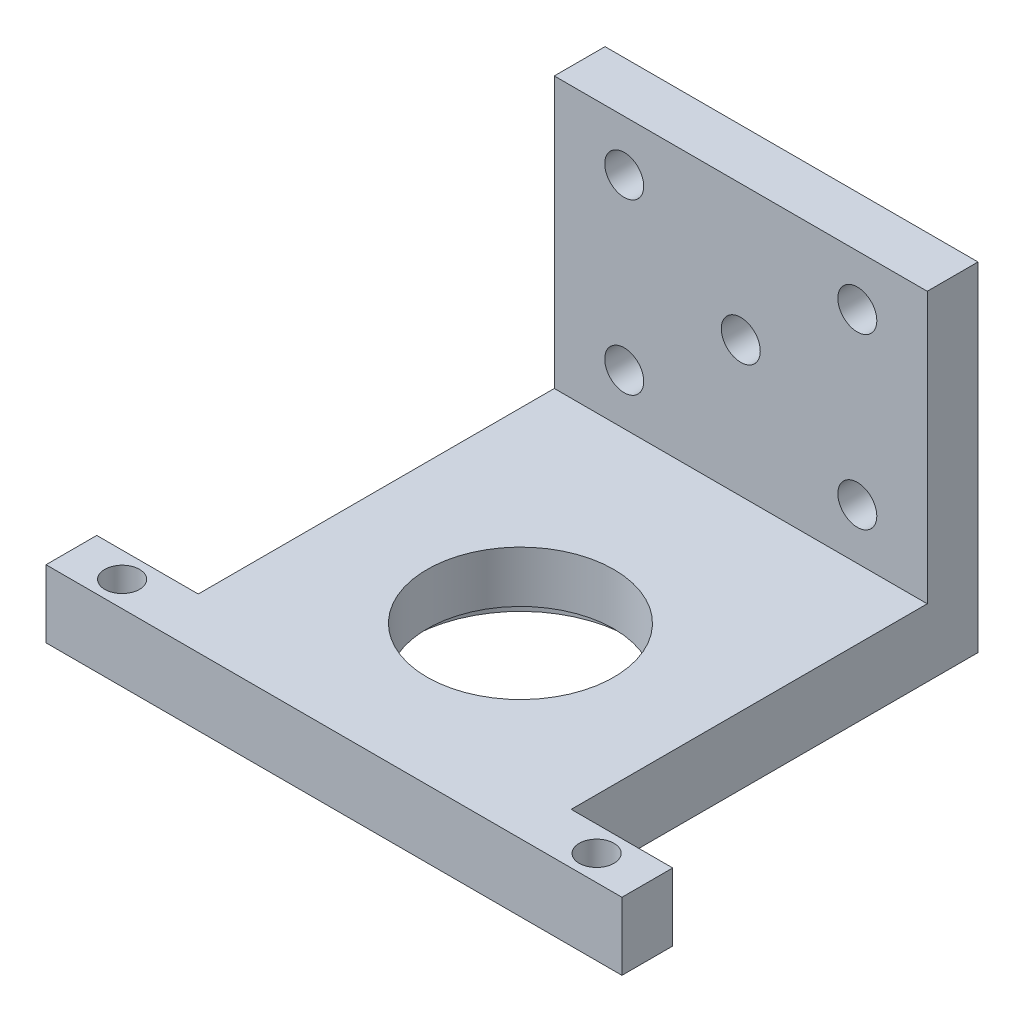
ISO-10303-21;
HEADER;
FILE_DESCRIPTION(('STEP AP214'),'2;1');
FILE_NAME('part.step','',(''),(''),'','','');
FILE_SCHEMA(('AUTOMOTIVE_DESIGN { 1 0 10303 214 1 1 1 1 }'));
ENDSEC;
DATA;
#1=APPLICATION_CONTEXT('core data for automotive mechanical design processes');
#2=APPLICATION_PROTOCOL_DEFINITION('international standard','automotive_design',2000,#1);
#3=PRODUCT_CONTEXT('',#1,'mechanical');
#4=PRODUCT('Part','Part','',(#3));
#5=PRODUCT_RELATED_PRODUCT_CATEGORY('part','',(#4));
#6=PRODUCT_DEFINITION_FORMATION('','',#4);
#7=PRODUCT_DEFINITION_CONTEXT('part definition',#1,'design');
#8=PRODUCT_DEFINITION('design','',#6,#7);
#9=PRODUCT_DEFINITION_SHAPE('','',#8);
#10=(LENGTH_UNIT() NAMED_UNIT(*) SI_UNIT(.MILLI.,.METRE.));
#11=(NAMED_UNIT(*) PLANE_ANGLE_UNIT() SI_UNIT($,.RADIAN.));
#12=(NAMED_UNIT(*) SI_UNIT($,.STERADIAN.) SOLID_ANGLE_UNIT());
#13=UNCERTAINTY_MEASURE_WITH_UNIT(LENGTH_MEASURE(1.E-05),#10,'distance_accuracy_value','');
#14=(GEOMETRIC_REPRESENTATION_CONTEXT(3) GLOBAL_UNCERTAINTY_ASSIGNED_CONTEXT((#13)) GLOBAL_UNIT_ASSIGNED_CONTEXT((#10,
#11,#12)) REPRESENTATION_CONTEXT('',''));
#15=CARTESIAN_POINT('',(0.,0.,0.));
#16=DIRECTION('',(0.,0.,1.));
#17=DIRECTION('',(1.,0.,0.));
#18=AXIS2_PLACEMENT_3D('',#15,#16,#17);
#19=CARTESIAN_POINT('',(0.,6.35,0.));
#20=DIRECTION('',(1.,0.,0.));
#21=DIRECTION('',(0.,0.,-1.));
#22=AXIS2_PLACEMENT_3D('',#19,#20,#21);
#23=PLANE('',#22);
#24=DIRECTION('',(0.,-1.,0.));
#25=VECTOR('',#24,1.);
#26=CARTESIAN_POINT('',(0.,6.35,-4.7625));
#27=LINE('',#26,#25);
#28=CARTESIAN_POINT('',(0.,6.35,-4.7625));
#29=VERTEX_POINT('',#28);
#30=CARTESIAN_POINT('',(0.,0.,-4.7625));
#31=VERTEX_POINT('',#30);
#32=EDGE_CURVE('E60',#29,#31,#27,.T.);
#33=ORIENTED_EDGE('',*,*,#32,.F.);
#34=DIRECTION('',(0.,0.,1.));
#35=VECTOR('',#34,1.);
#36=CARTESIAN_POINT('',(0.,6.35,0.));
#37=LINE('',#36,#35);
#38=CARTESIAN_POINT('',(0.,6.35,-38.175));
#39=VERTEX_POINT('',#38);
#40=EDGE_CURVE('E130',#39,#29,#37,.T.);
#41=ORIENTED_EDGE('',*,*,#40,.F.);
#42=DIRECTION('',(0.,-1.,0.));
#43=VECTOR('',#42,1.);
#44=CARTESIAN_POINT('',(0.,31.75,-38.175));
#45=LINE('',#44,#43);
#46=CARTESIAN_POINT('',(0.,31.75,-38.175));
#47=VERTEX_POINT('',#46);
#48=EDGE_CURVE('E263',#47,#39,#45,.T.);
#49=ORIENTED_EDGE('',*,*,#48,.F.);
#50=DIRECTION('',(0.,0.,1.));
#51=VECTOR('',#50,1.);
#52=CARTESIAN_POINT('',(0.,31.75,-42.9375));
#53=LINE('',#52,#51);
#54=CARTESIAN_POINT('',(0.,31.75,-42.9375));
#55=VERTEX_POINT('',#54);
#56=EDGE_CURVE('E241',#55,#47,#53,.T.);
#57=ORIENTED_EDGE('',*,*,#56,.F.);
#58=DIRECTION('',(0.,-1.,0.));
#59=VECTOR('',#58,1.);
#60=CARTESIAN_POINT('',(0.,6.35,-42.9375));
#61=LINE('',#60,#59);
#62=CARTESIAN_POINT('',(0.,0.,-42.9375));
#63=VERTEX_POINT('',#62);
#64=EDGE_CURVE('E45',#55,#63,#61,.T.);
#65=ORIENTED_EDGE('',*,*,#64,.T.);
#66=DIRECTION('',(0.,0.,1.));
#67=VECTOR('',#66,1.);
#68=CARTESIAN_POINT('',(0.,0.,0.));
#69=LINE('',#68,#67);
#70=EDGE_CURVE('E267',#63,#31,#69,.T.);
#71=ORIENTED_EDGE('',*,*,#70,.T.);
#72=EDGE_LOOP('',(#33,#41,#49,#57,#65,#71));
#73=FACE_BOUND('',#72,.T.);
#74=ADVANCED_FACE('F37',(#73),#23,.F.);
#75=CARTESIAN_POINT('',(17.5,31.75,-17.5));
#76=DIRECTION('',(0.,-1.,0.));
#77=DIRECTION('',(0.,0.,-1.));
#78=AXIS2_PLACEMENT_3D('',#75,#76,#77);
#79=CYLINDRICAL_SURFACE('',#78,8.763);
#80=CARTESIAN_POINT('',(17.5,6.35,-17.5));
#81=DIRECTION('',(0.,-1.,0.));
#82=DIRECTION('',(0.,0.,-1.));
#83=AXIS2_PLACEMENT_3D('',#80,#81,#82);
#84=CIRCLE('',#83,8.763);
#85=CARTESIAN_POINT('',(17.5,6.35,-26.263));
#86=VERTEX_POINT('',#85);
#87=EDGE_CURVE('E236',#86,#86,#84,.T.);
#88=ORIENTED_EDGE('',*,*,#87,.F.);
#89=EDGE_LOOP('',(#88));
#90=FACE_BOUND('',#89,.T.);
#91=CARTESIAN_POINT('',(17.5,1.524,-17.5));
#92=DIRECTION('',(0.,-1.,0.));
#93=DIRECTION('',(0.,0.,-1.));
#94=AXIS2_PLACEMENT_3D('',#91,#92,#93);
#95=CIRCLE('',#94,8.763);
#96=CARTESIAN_POINT('',(17.5,1.524,-26.263));
#97=VERTEX_POINT('',#96);
#98=EDGE_CURVE('E179',#97,#97,#95,.T.);
#99=ORIENTED_EDGE('',*,*,#98,.T.);
#100=EDGE_LOOP('',(#99));
#101=FACE_BOUND('',#100,.T.);
#102=ADVANCED_FACE('F310',(#90,#101),#79,.F.);
#103=CARTESIAN_POINT('',(0.,6.35,0.));
#104=DIRECTION('',(0.,-1.,0.));
#105=DIRECTION('',(0.,0.,-1.));
#106=AXIS2_PLACEMENT_3D('',#103,#104,#105);
#107=PLANE('',#106);
#108=CARTESIAN_POINT('',(39.7625,6.35,-2.38125));
#109=DIRECTION('',(0.,-1.,0.));
#110=DIRECTION('',(0.,0.,-1.));
#111=AXIS2_PLACEMENT_3D('',#108,#109,#110);
#112=CIRCLE('',#111,1.63195);
#113=CARTESIAN_POINT('',(39.7625,6.35,-4.0132));
#114=VERTEX_POINT('',#113);
#115=EDGE_CURVE('E538',#114,#114,#112,.T.);
#116=ORIENTED_EDGE('',*,*,#115,.T.);
#117=EDGE_LOOP('',(#116));
#118=FACE_BOUND('',#117,.T.);
#119=CARTESIAN_POINT('',(-4.7625,6.35,-2.38125));
#120=DIRECTION('',(0.,-1.,0.));
#121=DIRECTION('',(0.,0.,-1.));
#122=AXIS2_PLACEMENT_3D('',#119,#120,#121);
#123=CIRCLE('',#122,1.63195);
#124=CARTESIAN_POINT('',(-4.7625,6.35,-4.0132));
#125=VERTEX_POINT('',#124);
#126=EDGE_CURVE('E153',#125,#125,#123,.T.);
#127=ORIENTED_EDGE('',*,*,#126,.T.);
#128=EDGE_LOOP('',(#127));
#129=FACE_BOUND('',#128,.T.);
#130=ORIENTED_EDGE('',*,*,#87,.T.);
#131=EDGE_LOOP('',(#130));
#132=FACE_BOUND('',#131,.T.);
#133=DIRECTION('',(1.,0.,0.));
#134=VECTOR('',#133,1.);
#135=CARTESIAN_POINT('',(0.,6.35,-38.175));
#136=LINE('',#135,#134);
#137=CARTESIAN_POINT('',(35.,6.35,-38.175));
#138=VERTEX_POINT('',#137);
#139=EDGE_CURVE('E240',#39,#138,#136,.T.);
#140=ORIENTED_EDGE('',*,*,#139,.F.);
#141=ORIENTED_EDGE('',*,*,#40,.T.);
#142=DIRECTION('',(1.,0.,0.));
#143=VECTOR('',#142,1.);
#144=CARTESIAN_POINT('',(0.,6.35,-4.7625));
#145=LINE('',#144,#143);
#146=CARTESIAN_POINT('',(-9.525,6.35,-4.7625));
#147=VERTEX_POINT('',#146);
#148=EDGE_CURVE('E165',#147,#29,#145,.T.);
#149=ORIENTED_EDGE('',*,*,#148,.F.);
#150=DIRECTION('',(0.,0.,-1.));
#151=VECTOR('',#150,1.);
#152=CARTESIAN_POINT('',(-9.525,6.35,-4.7625));
#153=LINE('',#152,#151);
#154=CARTESIAN_POINT('',(-9.525,6.35,0.));
#155=VERTEX_POINT('',#154);
#156=EDGE_CURVE('E124',#155,#147,#153,.T.);
#157=ORIENTED_EDGE('',*,*,#156,.F.);
#158=DIRECTION('',(1.,0.,0.));
#159=VECTOR('',#158,1.);
#160=CARTESIAN_POINT('',(0.,6.35,0.));
#161=LINE('',#160,#159);
#162=CARTESIAN_POINT('',(44.525,6.35,0.));
#163=VERTEX_POINT('',#162);
#164=EDGE_CURVE('E115',#155,#163,#161,.T.);
#165=ORIENTED_EDGE('',*,*,#164,.T.);
#166=DIRECTION('',(0.,0.,1.));
#167=VECTOR('',#166,1.);
#168=CARTESIAN_POINT('',(44.525,6.35,-4.7625));
#169=LINE('',#168,#167);
#170=CARTESIAN_POINT('',(44.525,6.35,-4.7625));
#171=VERTEX_POINT('',#170);
#172=EDGE_CURVE('E120',#171,#163,#169,.T.);
#173=ORIENTED_EDGE('',*,*,#172,.F.);
#174=DIRECTION('',(1.,0.,0.));
#175=VECTOR('',#174,1.);
#176=CARTESIAN_POINT('',(44.525,6.35,-4.7625));
#177=LINE('',#176,#175);
#178=CARTESIAN_POINT('',(35.,6.35,-4.7625));
#179=VERTEX_POINT('',#178);
#180=EDGE_CURVE('E141',#179,#171,#177,.T.);
#181=ORIENTED_EDGE('',*,*,#180,.F.);
#182=DIRECTION('',(0.,0.,-1.));
#183=VECTOR('',#182,1.);
#184=CARTESIAN_POINT('',(35.,6.35,0.));
#185=LINE('',#184,#183);
#186=EDGE_CURVE('E129',#179,#138,#185,.T.);
#187=ORIENTED_EDGE('',*,*,#186,.T.);
#188=EDGE_LOOP('',(#140,#141,#149,#157,#165,#173,#181,#187));
#189=FACE_BOUND('',#188,.T.);
#190=ADVANCED_FACE('F117',(#118,#129,#132,#189),#107,.F.);
#191=CARTESIAN_POINT('',(0.,6.35,0.));
#192=DIRECTION('',(0.,0.,-1.));
#193=DIRECTION('',(-1.,0.,0.));
#194=AXIS2_PLACEMENT_3D('',#191,#192,#193);
#195=PLANE('',#194);
#196=DIRECTION('',(1.,0.,0.));
#197=VECTOR('',#196,1.);
#198=CARTESIAN_POINT('',(0.,0.,0.));
#199=LINE('',#198,#197);
#200=CARTESIAN_POINT('',(-9.525,0.,0.));
#201=VERTEX_POINT('',#200);
#202=CARTESIAN_POINT('',(44.525,0.,0.));
#203=VERTEX_POINT('',#202);
#204=EDGE_CURVE('E135',#201,#203,#199,.T.);
#205=ORIENTED_EDGE('',*,*,#204,.T.);
#206=DIRECTION('',(0.,-1.,0.));
#207=VECTOR('',#206,1.);
#208=CARTESIAN_POINT('',(44.525,6.35,0.));
#209=LINE('',#208,#207);
#210=EDGE_CURVE('E133',#163,#203,#209,.T.);
#211=ORIENTED_EDGE('',*,*,#210,.F.);
#212=ORIENTED_EDGE('',*,*,#164,.F.);
#213=DIRECTION('',(0.,-1.,0.));
#214=VECTOR('',#213,1.);
#215=CARTESIAN_POINT('',(-9.525,6.35,0.));
#216=LINE('',#215,#214);
#217=EDGE_CURVE('E170',#155,#201,#216,.T.);
#218=ORIENTED_EDGE('',*,*,#217,.T.);
#219=EDGE_LOOP('',(#205,#211,#212,#218));
#220=FACE_BOUND('',#219,.T.);
#221=ADVANCED_FACE('F134',(#220),#195,.F.);
#222=CARTESIAN_POINT('',(35.,6.35,0.));
#223=DIRECTION('',(-1.,0.,0.));
#224=DIRECTION('',(0.,0.,1.));
#225=AXIS2_PLACEMENT_3D('',#222,#223,#224);
#226=PLANE('',#225);
#227=ORIENTED_EDGE('',*,*,#186,.F.);
#228=DIRECTION('',(0.,-1.,0.));
#229=VECTOR('',#228,1.);
#230=CARTESIAN_POINT('',(35.,6.35,-4.7625));
#231=LINE('',#230,#229);
#232=CARTESIAN_POINT('',(35.,0.,-4.7625));
#233=VERTEX_POINT('',#232);
#234=EDGE_CURVE('E140',#179,#233,#231,.T.);
#235=ORIENTED_EDGE('',*,*,#234,.T.);
#236=DIRECTION('',(0.,0.,-1.));
#237=VECTOR('',#236,1.);
#238=CARTESIAN_POINT('',(35.,0.,0.));
#239=LINE('',#238,#237);
#240=CARTESIAN_POINT('',(35.,0.,-42.9375));
#241=VERTEX_POINT('',#240);
#242=EDGE_CURVE('E277',#233,#241,#239,.T.);
#243=ORIENTED_EDGE('',*,*,#242,.T.);
#244=DIRECTION('',(0.,-1.,0.));
#245=VECTOR('',#244,1.);
#246=CARTESIAN_POINT('',(35.,6.35,-42.9375));
#247=LINE('',#246,#245);
#248=CARTESIAN_POINT('',(35.,31.75,-42.9375));
#249=VERTEX_POINT('',#248);
#250=EDGE_CURVE('E11',#249,#241,#247,.T.);
#251=ORIENTED_EDGE('',*,*,#250,.F.);
#252=DIRECTION('',(0.,0.,-1.));
#253=VECTOR('',#252,1.);
#254=CARTESIAN_POINT('',(35.,31.75,-42.9375));
#255=LINE('',#254,#253);
#256=CARTESIAN_POINT('',(35.,31.75,-38.175));
#257=VERTEX_POINT('',#256);
#258=EDGE_CURVE('E248',#257,#249,#255,.T.);
#259=ORIENTED_EDGE('',*,*,#258,.F.);
#260=DIRECTION('',(0.,-1.,0.));
#261=VECTOR('',#260,1.);
#262=CARTESIAN_POINT('',(35.,31.75,-38.175));
#263=LINE('',#262,#261);
#264=EDGE_CURVE('E256',#257,#138,#263,.T.);
#265=ORIENTED_EDGE('',*,*,#264,.T.);
#266=EDGE_LOOP('',(#227,#235,#243,#251,#259,#265));
#267=FACE_BOUND('',#266,.T.);
#268=ADVANCED_FACE('F341',(#267),#226,.F.);
#269=CARTESIAN_POINT('',(0.,6.35,-42.9375));
#270=DIRECTION('',(0.,0.,1.));
#271=DIRECTION('',(1.,0.,0.));
#272=AXIS2_PLACEMENT_3D('',#269,#270,#271);
#273=PLANE('',#272);
#274=CARTESIAN_POINT('',(17.5,19.05,-42.9375));
#275=DIRECTION('',(0.,0.,1.));
#276=DIRECTION('',(1.,0.,0.));
#277=AXIS2_PLACEMENT_3D('',#274,#275,#276);
#278=CIRCLE('',#277,1.8288);
#279=CARTESIAN_POINT('',(19.3288,19.05,-42.9375));
#280=VERTEX_POINT('',#279);
#281=EDGE_CURVE('E200',#280,#280,#278,.T.);
#282=ORIENTED_EDGE('',*,*,#281,.T.);
#283=EDGE_LOOP('',(#282));
#284=FACE_BOUND('',#283,.T.);
#285=CARTESIAN_POINT('',(6.5625,11.1125,-42.9375));
#286=DIRECTION('',(0.,0.,1.));
#287=DIRECTION('',(1.,0.,0.));
#288=AXIS2_PLACEMENT_3D('',#285,#286,#287);
#289=CIRCLE('',#288,1.8288);
#290=CARTESIAN_POINT('',(8.3913,11.1125,-42.9375));
#291=VERTEX_POINT('',#290);
#292=EDGE_CURVE('E208',#291,#291,#289,.T.);
#293=ORIENTED_EDGE('',*,*,#292,.T.);
#294=EDGE_LOOP('',(#293));
#295=FACE_BOUND('',#294,.T.);
#296=CARTESIAN_POINT('',(28.4375,26.9875,-42.9375));
#297=DIRECTION('',(0.,0.,1.));
#298=DIRECTION('',(1.,0.,0.));
#299=AXIS2_PLACEMENT_3D('',#296,#297,#298);
#300=CIRCLE('',#299,1.8288);
#301=CARTESIAN_POINT('',(30.2663,26.9875,-42.9375));
#302=VERTEX_POINT('',#301);
#303=EDGE_CURVE('E216',#302,#302,#300,.T.);
#304=ORIENTED_EDGE('',*,*,#303,.T.);
#305=EDGE_LOOP('',(#304));
#306=FACE_BOUND('',#305,.T.);
#307=CARTESIAN_POINT('',(28.4375,11.1125,-42.9375));
#308=DIRECTION('',(0.,0.,1.));
#309=DIRECTION('',(1.,0.,0.));
#310=AXIS2_PLACEMENT_3D('',#307,#308,#309);
#311=CIRCLE('',#310,1.8288);
#312=CARTESIAN_POINT('',(30.2663,11.1125,-42.9375));
#313=VERTEX_POINT('',#312);
#314=EDGE_CURVE('E224',#313,#313,#311,.T.);
#315=ORIENTED_EDGE('',*,*,#314,.T.);
#316=EDGE_LOOP('',(#315));
#317=FACE_BOUND('',#316,.T.);
#318=CARTESIAN_POINT('',(6.5625,26.9875,-42.9375));
#319=DIRECTION('',(0.,0.,1.));
#320=DIRECTION('',(1.,0.,0.));
#321=AXIS2_PLACEMENT_3D('',#318,#319,#320);
#322=CIRCLE('',#321,1.8288);
#323=CARTESIAN_POINT('',(8.3913,26.9875,-42.9375));
#324=VERTEX_POINT('',#323);
#325=EDGE_CURVE('E232',#324,#324,#322,.T.);
#326=ORIENTED_EDGE('',*,*,#325,.T.);
#327=EDGE_LOOP('',(#326));
#328=FACE_BOUND('',#327,.T.);
#329=DIRECTION('',(-1.,0.,0.));
#330=VECTOR('',#329,1.);
#331=CARTESIAN_POINT('',(0.,0.,-42.9375));
#332=LINE('',#331,#330);
#333=EDGE_CURVE('E269',#241,#63,#332,.T.);
#334=ORIENTED_EDGE('',*,*,#333,.T.);
#335=ORIENTED_EDGE('',*,*,#64,.F.);
#336=DIRECTION('',(-1.,0.,0.));
#337=VECTOR('',#336,1.);
#338=CARTESIAN_POINT('',(0.,31.75,-42.9375));
#339=LINE('',#338,#337);
#340=EDGE_CURVE('E252',#249,#55,#339,.T.);
#341=ORIENTED_EDGE('',*,*,#340,.F.);
#342=ORIENTED_EDGE('',*,*,#250,.T.);
#343=EDGE_LOOP('',(#334,#335,#341,#342));
#344=FACE_BOUND('',#343,.T.);
#345=ADVANCED_FACE('F337',(#284,#295,#306,#317,#328,#344),#273,.F.);
#346=CARTESIAN_POINT('',(0.,0.,0.));
#347=DIRECTION('',(0.,-1.,0.));
#348=DIRECTION('',(0.,0.,-1.));
#349=AXIS2_PLACEMENT_3D('',#346,#347,#348);
#350=PLANE('',#349);
#351=CARTESIAN_POINT('',(39.7625,0.,-2.38125));
#352=DIRECTION('',(0.,-1.,0.));
#353=DIRECTION('',(0.,0.,-1.));
#354=AXIS2_PLACEMENT_3D('',#351,#352,#353);
#355=CIRCLE('',#354,1.63195);
#356=CARTESIAN_POINT('',(39.7625,0.,-4.0132));
#357=VERTEX_POINT('',#356);
#358=EDGE_CURVE('E535',#357,#357,#355,.T.);
#359=ORIENTED_EDGE('',*,*,#358,.F.);
#360=EDGE_LOOP('',(#359));
#361=FACE_BOUND('',#360,.T.);
#362=CARTESIAN_POINT('',(-4.7625,0.,-2.38125));
#363=DIRECTION('',(0.,-1.,0.));
#364=DIRECTION('',(0.,0.,-1.));
#365=AXIS2_PLACEMENT_3D('',#362,#363,#364);
#366=CIRCLE('',#365,1.63195);
#367=CARTESIAN_POINT('',(-4.7625,0.,-4.0132));
#368=VERTEX_POINT('',#367);
#369=EDGE_CURVE('E540',#368,#368,#366,.T.);
#370=ORIENTED_EDGE('',*,*,#369,.F.);
#371=EDGE_LOOP('',(#370));
#372=FACE_BOUND('',#371,.T.);
#373=CARTESIAN_POINT('',(17.5,0.,-17.5));
#374=DIRECTION('',(0.,-1.,0.));
#375=DIRECTION('',(0.,0.,-1.));
#376=AXIS2_PLACEMENT_3D('',#373,#374,#375);
#377=CIRCLE('',#376,10.3505);
#378=CARTESIAN_POINT('',(17.5,0.,-27.8505));
#379=VERTEX_POINT('',#378);
#380=EDGE_CURVE('E188',#379,#379,#377,.T.);
#381=ORIENTED_EDGE('',*,*,#380,.F.);
#382=EDGE_LOOP('',(#381));
#383=FACE_BOUND('',#382,.T.);
#384=ORIENTED_EDGE('',*,*,#70,.F.);
#385=ORIENTED_EDGE('',*,*,#333,.F.);
#386=ORIENTED_EDGE('',*,*,#242,.F.);
#387=DIRECTION('',(1.,0.,0.));
#388=VECTOR('',#387,1.);
#389=CARTESIAN_POINT('',(44.525,0.,-4.7625));
#390=LINE('',#389,#388);
#391=CARTESIAN_POINT('',(44.525,0.,-4.7625));
#392=VERTEX_POINT('',#391);
#393=EDGE_CURVE('E52',#233,#392,#390,.T.);
#394=ORIENTED_EDGE('',*,*,#393,.T.);
#395=DIRECTION('',(0.,0.,1.));
#396=VECTOR('',#395,1.);
#397=CARTESIAN_POINT('',(44.525,0.,-4.7625));
#398=LINE('',#397,#396);
#399=EDGE_CURVE('E150',#392,#203,#398,.T.);
#400=ORIENTED_EDGE('',*,*,#399,.T.);
#401=ORIENTED_EDGE('',*,*,#204,.F.);
#402=DIRECTION('',(0.,0.,-1.));
#403=VECTOR('',#402,1.);
#404=CARTESIAN_POINT('',(-9.525,0.,-4.7625));
#405=LINE('',#404,#403);
#406=CARTESIAN_POINT('',(-9.525,0.,-4.7625));
#407=VERTEX_POINT('',#406);
#408=EDGE_CURVE('E160',#201,#407,#405,.T.);
#409=ORIENTED_EDGE('',*,*,#408,.T.);
#410=DIRECTION('',(1.,0.,0.));
#411=VECTOR('',#410,1.);
#412=CARTESIAN_POINT('',(0.,0.,-4.7625));
#413=LINE('',#412,#411);
#414=EDGE_CURVE('E166',#407,#31,#413,.T.);
#415=ORIENTED_EDGE('',*,*,#414,.T.);
#416=EDGE_LOOP('',(#384,#385,#386,#394,#400,#401,#409,#415));
#417=FACE_BOUND('',#416,.T.);
#418=ADVANCED_FACE('F290',(#361,#372,#383,#417),#350,.T.);
#419=CARTESIAN_POINT('',(0.,31.75,-38.175));
#420=DIRECTION('',(0.,0.,-1.));
#421=DIRECTION('',(-1.,0.,0.));
#422=AXIS2_PLACEMENT_3D('',#419,#420,#421);
#423=PLANE('',#422);
#424=CARTESIAN_POINT('',(17.5,19.05,-38.175));
#425=DIRECTION('',(0.,0.,1.));
#426=DIRECTION('',(1.,0.,0.));
#427=AXIS2_PLACEMENT_3D('',#424,#425,#426);
#428=CIRCLE('',#427,1.8288);
#429=CARTESIAN_POINT('',(19.3288,19.05,-38.175));
#430=VERTEX_POINT('',#429);
#431=EDGE_CURVE('E193',#430,#430,#428,.T.);
#432=ORIENTED_EDGE('',*,*,#431,.F.);
#433=EDGE_LOOP('',(#432));
#434=FACE_BOUND('',#433,.T.);
#435=CARTESIAN_POINT('',(6.5625,11.1125,-38.175));
#436=DIRECTION('',(0.,0.,1.));
#437=DIRECTION('',(1.,0.,0.));
#438=AXIS2_PLACEMENT_3D('',#435,#436,#437);
#439=CIRCLE('',#438,1.8288);
#440=CARTESIAN_POINT('',(8.3913,11.1125,-38.175));
#441=VERTEX_POINT('',#440);
#442=EDGE_CURVE('E204',#441,#441,#439,.T.);
#443=ORIENTED_EDGE('',*,*,#442,.F.);
#444=EDGE_LOOP('',(#443));
#445=FACE_BOUND('',#444,.T.);
#446=CARTESIAN_POINT('',(28.4375,26.9875,-38.175));
#447=DIRECTION('',(0.,0.,1.));
#448=DIRECTION('',(1.,0.,0.));
#449=AXIS2_PLACEMENT_3D('',#446,#447,#448);
#450=CIRCLE('',#449,1.8288);
#451=CARTESIAN_POINT('',(30.2663,26.9875,-38.175));
#452=VERTEX_POINT('',#451);
#453=EDGE_CURVE('E212',#452,#452,#450,.T.);
#454=ORIENTED_EDGE('',*,*,#453,.F.);
#455=EDGE_LOOP('',(#454));
#456=FACE_BOUND('',#455,.T.);
#457=CARTESIAN_POINT('',(28.4375,11.1125,-38.175));
#458=DIRECTION('',(0.,0.,1.));
#459=DIRECTION('',(1.,0.,0.));
#460=AXIS2_PLACEMENT_3D('',#457,#458,#459);
#461=CIRCLE('',#460,1.8288);
#462=CARTESIAN_POINT('',(30.2663,11.1125,-38.175));
#463=VERTEX_POINT('',#462);
#464=EDGE_CURVE('E220',#463,#463,#461,.T.);
#465=ORIENTED_EDGE('',*,*,#464,.F.);
#466=EDGE_LOOP('',(#465));
#467=FACE_BOUND('',#466,.T.);
#468=CARTESIAN_POINT('',(6.5625,26.9875,-38.175));
#469=DIRECTION('',(0.,0.,1.));
#470=DIRECTION('',(1.,0.,0.));
#471=AXIS2_PLACEMENT_3D('',#468,#469,#470);
#472=CIRCLE('',#471,1.8288);
#473=CARTESIAN_POINT('',(8.3913,26.9875,-38.175));
#474=VERTEX_POINT('',#473);
#475=EDGE_CURVE('E228',#474,#474,#472,.T.);
#476=ORIENTED_EDGE('',*,*,#475,.F.);
#477=EDGE_LOOP('',(#476));
#478=FACE_BOUND('',#477,.T.);
#479=ORIENTED_EDGE('',*,*,#139,.T.);
#480=ORIENTED_EDGE('',*,*,#264,.F.);
#481=DIRECTION('',(1.,0.,0.));
#482=VECTOR('',#481,1.);
#483=CARTESIAN_POINT('',(0.,31.75,-38.175));
#484=LINE('',#483,#482);
#485=EDGE_CURVE('E245',#47,#257,#484,.T.);
#486=ORIENTED_EDGE('',*,*,#485,.F.);
#487=ORIENTED_EDGE('',*,*,#48,.T.);
#488=EDGE_LOOP('',(#479,#480,#486,#487));
#489=FACE_BOUND('',#488,.T.);
#490=ADVANCED_FACE('F330',(#434,#445,#456,#467,#478,#489),#423,.F.);
#491=CARTESIAN_POINT('',(0.,31.75,0.));
#492=DIRECTION('',(0.,1.,0.));
#493=DIRECTION('',(0.,0.,1.));
#494=AXIS2_PLACEMENT_3D('',#491,#492,#493);
#495=PLANE('',#494);
#496=ORIENTED_EDGE('',*,*,#56,.T.);
#497=ORIENTED_EDGE('',*,*,#485,.T.);
#498=ORIENTED_EDGE('',*,*,#258,.T.);
#499=ORIENTED_EDGE('',*,*,#340,.T.);
#500=EDGE_LOOP('',(#496,#497,#498,#499));
#501=FACE_BOUND('',#500,.T.);
#502=ADVANCED_FACE('F327',(#501),#495,.T.);
#503=CARTESIAN_POINT('',(6.5625,26.9875,-38.175));
#504=DIRECTION('',(0.,0.,1.));
#505=DIRECTION('',(1.,0.,0.));
#506=AXIS2_PLACEMENT_3D('',#503,#504,#505);
#507=CYLINDRICAL_SURFACE('',#506,1.8288);
#508=ORIENTED_EDGE('',*,*,#325,.F.);
#509=EDGE_LOOP('',(#508));
#510=FACE_BOUND('',#509,.T.);
#511=ORIENTED_EDGE('',*,*,#475,.T.);
#512=EDGE_LOOP('',(#511));
#513=FACE_BOUND('',#512,.T.);
#514=ADVANCED_FACE('F325',(#510,#513),#507,.F.);
#515=CARTESIAN_POINT('',(28.4375,11.1125,-38.175));
#516=DIRECTION('',(0.,0.,1.));
#517=DIRECTION('',(1.,0.,0.));
#518=AXIS2_PLACEMENT_3D('',#515,#516,#517);
#519=CYLINDRICAL_SURFACE('',#518,1.8288);
#520=ORIENTED_EDGE('',*,*,#314,.F.);
#521=EDGE_LOOP('',(#520));
#522=FACE_BOUND('',#521,.T.);
#523=ORIENTED_EDGE('',*,*,#464,.T.);
#524=EDGE_LOOP('',(#523));
#525=FACE_BOUND('',#524,.T.);
#526=ADVANCED_FACE('F378',(#522,#525),#519,.F.);
#527=CARTESIAN_POINT('',(28.4375,26.9875,-38.175));
#528=DIRECTION('',(0.,0.,1.));
#529=DIRECTION('',(1.,0.,0.));
#530=AXIS2_PLACEMENT_3D('',#527,#528,#529);
#531=CYLINDRICAL_SURFACE('',#530,1.8288);
#532=ORIENTED_EDGE('',*,*,#303,.F.);
#533=EDGE_LOOP('',(#532));
#534=FACE_BOUND('',#533,.T.);
#535=ORIENTED_EDGE('',*,*,#453,.T.);
#536=EDGE_LOOP('',(#535));
#537=FACE_BOUND('',#536,.T.);
#538=ADVANCED_FACE('F385',(#534,#537),#531,.F.);
#539=CARTESIAN_POINT('',(6.5625,11.1125,-38.175));
#540=DIRECTION('',(0.,0.,1.));
#541=DIRECTION('',(1.,0.,0.));
#542=AXIS2_PLACEMENT_3D('',#539,#540,#541);
#543=CYLINDRICAL_SURFACE('',#542,1.8288);
#544=ORIENTED_EDGE('',*,*,#292,.F.);
#545=EDGE_LOOP('',(#544));
#546=FACE_BOUND('',#545,.T.);
#547=ORIENTED_EDGE('',*,*,#442,.T.);
#548=EDGE_LOOP('',(#547));
#549=FACE_BOUND('',#548,.T.);
#550=ADVANCED_FACE('F392',(#546,#549),#543,.F.);
#551=CARTESIAN_POINT('',(17.5,19.05,-38.175));
#552=DIRECTION('',(0.,0.,1.));
#553=DIRECTION('',(1.,0.,0.));
#554=AXIS2_PLACEMENT_3D('',#551,#552,#553);
#555=CYLINDRICAL_SURFACE('',#554,1.8288);
#556=ORIENTED_EDGE('',*,*,#281,.F.);
#557=EDGE_LOOP('',(#556));
#558=FACE_BOUND('',#557,.T.);
#559=ORIENTED_EDGE('',*,*,#431,.T.);
#560=EDGE_LOOP('',(#559));
#561=FACE_BOUND('',#560,.T.);
#562=ADVANCED_FACE('F400',(#558,#561),#555,.F.);
#563=CARTESIAN_POINT('',(17.5,1.524,-17.5));
#564=DIRECTION('',(0.,-1.,0.));
#565=DIRECTION('',(0.,0.,-1.));
#566=AXIS2_PLACEMENT_3D('',#563,#564,#565);
#567=CYLINDRICAL_SURFACE('',#566,10.3505);
#568=CARTESIAN_POINT('',(17.5,1.524,-17.5));
#569=DIRECTION('',(0.,-1.,0.));
#570=DIRECTION('',(0.,0.,-1.));
#571=AXIS2_PLACEMENT_3D('',#568,#569,#570);
#572=CIRCLE('',#571,10.3505);
#573=CARTESIAN_POINT('',(17.5,1.524,-27.8505));
#574=VERTEX_POINT('',#573);
#575=EDGE_CURVE('E189',#574,#574,#572,.T.);
#576=ORIENTED_EDGE('',*,*,#575,.F.);
#577=EDGE_LOOP('',(#576));
#578=FACE_BOUND('',#577,.T.);
#579=ORIENTED_EDGE('',*,*,#380,.T.);
#580=EDGE_LOOP('',(#579));
#581=FACE_BOUND('',#580,.T.);
#582=ADVANCED_FACE('F408',(#578,#581),#567,.F.);
#583=CARTESIAN_POINT('',(17.5,1.524,-17.5));
#584=DIRECTION('',(0.,-1.,0.));
#585=DIRECTION('',(0.,0.,-1.));
#586=AXIS2_PLACEMENT_3D('',#583,#584,#585);
#587=PLANE('',#586);
#588=ORIENTED_EDGE('',*,*,#98,.F.);
#589=EDGE_LOOP('',(#588));
#590=FACE_BOUND('',#589,.T.);
#591=ORIENTED_EDGE('',*,*,#575,.T.);
#592=EDGE_LOOP('',(#591));
#593=FACE_BOUND('',#592,.T.);
#594=ADVANCED_FACE('F306',(#590,#593),#587,.T.);
#595=CARTESIAN_POINT('',(0.,6.35,-4.7625));
#596=DIRECTION('',(0.,0.,-1.));
#597=DIRECTION('',(-1.,0.,0.));
#598=AXIS2_PLACEMENT_3D('',#595,#596,#597);
#599=PLANE('',#598);
#600=ORIENTED_EDGE('',*,*,#414,.F.);
#601=DIRECTION('',(0.,-1.,0.));
#602=VECTOR('',#601,1.);
#603=CARTESIAN_POINT('',(-9.525,6.35,-4.7625));
#604=LINE('',#603,#602);
#605=EDGE_CURVE('E180',#147,#407,#604,.T.);
#606=ORIENTED_EDGE('',*,*,#605,.F.);
#607=ORIENTED_EDGE('',*,*,#148,.T.);
#608=ORIENTED_EDGE('',*,*,#32,.T.);
#609=EDGE_LOOP('',(#600,#606,#607,#608));
#610=FACE_BOUND('',#609,.T.);
#611=ADVANCED_FACE('F295',(#610),#599,.T.);
#612=CARTESIAN_POINT('',(-9.525,6.35,-4.7625));
#613=DIRECTION('',(-1.,0.,0.));
#614=DIRECTION('',(0.,0.,1.));
#615=AXIS2_PLACEMENT_3D('',#612,#613,#614);
#616=PLANE('',#615);
#617=ORIENTED_EDGE('',*,*,#408,.F.);
#618=ORIENTED_EDGE('',*,*,#217,.F.);
#619=ORIENTED_EDGE('',*,*,#156,.T.);
#620=ORIENTED_EDGE('',*,*,#605,.T.);
#621=EDGE_LOOP('',(#617,#618,#619,#620));
#622=FACE_BOUND('',#621,.T.);
#623=ADVANCED_FACE('F297',(#622),#616,.T.);
#624=CARTESIAN_POINT('',(44.525,6.35,-4.7625));
#625=DIRECTION('',(1.,0.,0.));
#626=DIRECTION('',(0.,0.,-1.));
#627=AXIS2_PLACEMENT_3D('',#624,#625,#626);
#628=PLANE('',#627);
#629=ORIENTED_EDGE('',*,*,#399,.F.);
#630=DIRECTION('',(0.,-1.,0.));
#631=VECTOR('',#630,1.);
#632=CARTESIAN_POINT('',(44.525,6.35,-4.7625));
#633=LINE('',#632,#631);
#634=EDGE_CURVE('E144',#171,#392,#633,.T.);
#635=ORIENTED_EDGE('',*,*,#634,.F.);
#636=ORIENTED_EDGE('',*,*,#172,.T.);
#637=ORIENTED_EDGE('',*,*,#210,.T.);
#638=EDGE_LOOP('',(#629,#635,#636,#637));
#639=FACE_BOUND('',#638,.T.);
#640=ADVANCED_FACE('F143',(#639),#628,.T.);
#641=CARTESIAN_POINT('',(44.525,6.35,-4.7625));
#642=DIRECTION('',(0.,0.,-1.));
#643=DIRECTION('',(-1.,0.,0.));
#644=AXIS2_PLACEMENT_3D('',#641,#642,#643);
#645=PLANE('',#644);
#646=ORIENTED_EDGE('',*,*,#393,.F.);
#647=ORIENTED_EDGE('',*,*,#234,.F.);
#648=ORIENTED_EDGE('',*,*,#180,.T.);
#649=ORIENTED_EDGE('',*,*,#634,.T.);
#650=EDGE_LOOP('',(#646,#647,#648,#649));
#651=FACE_BOUND('',#650,.T.);
#652=ADVANCED_FACE('F304',(#651),#645,.T.);
#653=CARTESIAN_POINT('',(-4.7625,0.,-2.38125));
#654=DIRECTION('',(0.,-1.,0.));
#655=DIRECTION('',(0.,0.,-1.));
#656=AXIS2_PLACEMENT_3D('',#653,#654,#655);
#657=CYLINDRICAL_SURFACE('',#656,1.63195);
#658=ORIENTED_EDGE('',*,*,#369,.T.);
#659=EDGE_LOOP('',(#658));
#660=FACE_BOUND('',#659,.T.);
#661=ORIENTED_EDGE('',*,*,#126,.F.);
#662=EDGE_LOOP('',(#661));
#663=FACE_BOUND('',#662,.T.);
#664=ADVANCED_FACE('F444',(#660,#663),#657,.F.);
#665=CARTESIAN_POINT('',(39.7625,0.,-2.38125));
#666=DIRECTION('',(0.,-1.,0.));
#667=DIRECTION('',(0.,0.,-1.));
#668=AXIS2_PLACEMENT_3D('',#665,#666,#667);
#669=CYLINDRICAL_SURFACE('',#668,1.63195);
#670=ORIENTED_EDGE('',*,*,#358,.T.);
#671=EDGE_LOOP('',(#670));
#672=FACE_BOUND('',#671,.T.);
#673=ORIENTED_EDGE('',*,*,#115,.F.);
#674=EDGE_LOOP('',(#673));
#675=FACE_BOUND('',#674,.T.);
#676=ADVANCED_FACE('F518',(#672,#675),#669,.F.);
#677=CLOSED_SHELL('',(#74,#102,#190,#221,#268,#345,#418,#490,#502,#514,#526,#538,#550,#562,#582,
#594,#611,#623,#640,#652,#664,#676));
#678=MANIFOLD_SOLID_BREP('B2',#677);
#679=ADVANCED_BREP_SHAPE_REPRESENTATION('',(#18,#678),#14);
#680=SHAPE_DEFINITION_REPRESENTATION(#9,#679);
ENDSEC;
END-ISO-10303-21;
